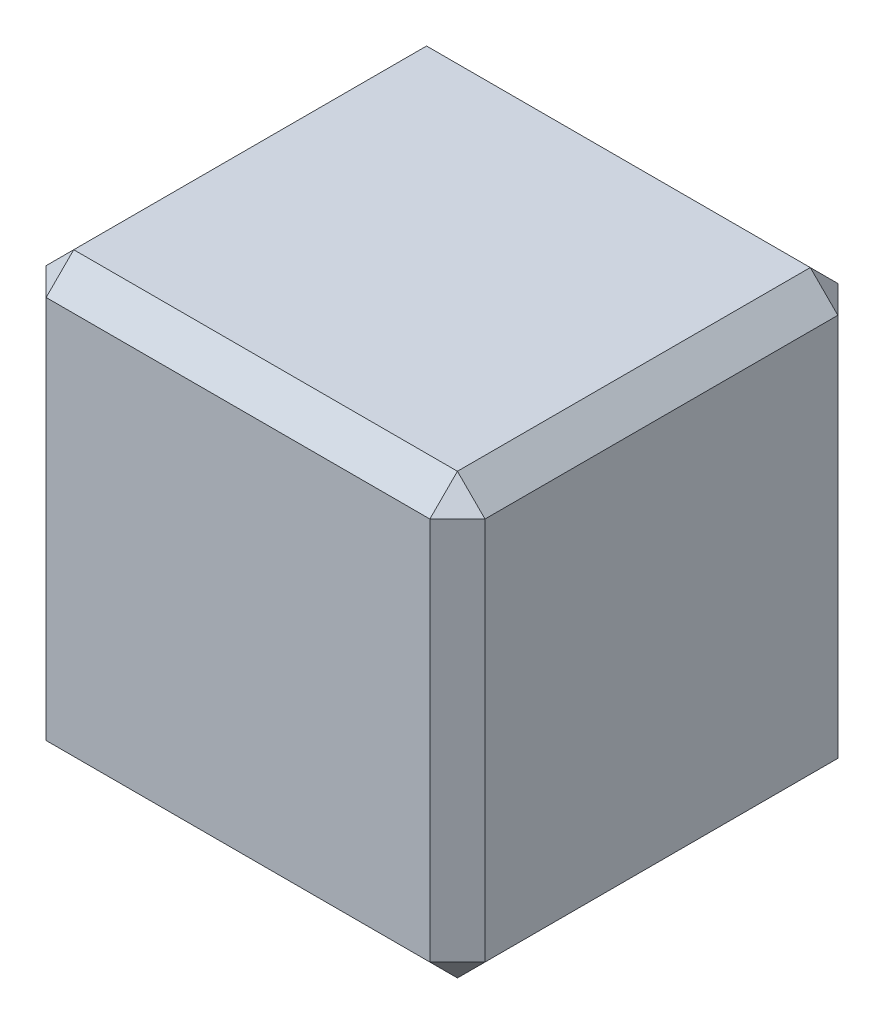
ISO-10303-21;
HEADER;
FILE_DESCRIPTION(('STEP AP214'),'2;1');
FILE_NAME('part.step','',(''),(''),'','','');
FILE_SCHEMA(('AUTOMOTIVE_DESIGN { 1 0 10303 214 1 1 1 1 }'));
ENDSEC;
DATA;
#1=APPLICATION_CONTEXT('core data for automotive mechanical design processes');
#2=APPLICATION_PROTOCOL_DEFINITION('international standard','automotive_design',2000,#1);
#3=PRODUCT_CONTEXT('',#1,'mechanical');
#4=PRODUCT('Part','Part','',(#3));
#5=PRODUCT_RELATED_PRODUCT_CATEGORY('part','',(#4));
#6=PRODUCT_DEFINITION_FORMATION('','',#4);
#7=PRODUCT_DEFINITION_CONTEXT('part definition',#1,'design');
#8=PRODUCT_DEFINITION('design','',#6,#7);
#9=PRODUCT_DEFINITION_SHAPE('','',#8);
#10=(LENGTH_UNIT() NAMED_UNIT(*) SI_UNIT(.MILLI.,.METRE.));
#11=(NAMED_UNIT(*) PLANE_ANGLE_UNIT() SI_UNIT($,.RADIAN.));
#12=(NAMED_UNIT(*) SI_UNIT($,.STERADIAN.) SOLID_ANGLE_UNIT());
#13=UNCERTAINTY_MEASURE_WITH_UNIT(LENGTH_MEASURE(1.E-05),#10,'distance_accuracy_value','');
#14=(GEOMETRIC_REPRESENTATION_CONTEXT(3) GLOBAL_UNCERTAINTY_ASSIGNED_CONTEXT((#13)) GLOBAL_UNIT_ASSIGNED_CONTEXT((#10,
#11,#12)) REPRESENTATION_CONTEXT('',''));
#15=CARTESIAN_POINT('',(0.,0.,0.));
#16=DIRECTION('',(0.,0.,1.));
#17=DIRECTION('',(1.,0.,0.));
#18=AXIS2_PLACEMENT_3D('',#15,#16,#17);
#19=CARTESIAN_POINT('',(12.6365,-12.6365,23.495));
#20=DIRECTION('',(-1.,0.,0.));
#21=DIRECTION('',(0.,0.,1.));
#22=AXIS2_PLACEMENT_3D('',#19,#20,#21);
#23=PLANE('',#22);
#24=DIRECTION('',(0.,-1.,0.));
#25=VECTOR('',#24,1.);
#26=CARTESIAN_POINT('',(12.6365,-12.6365,21.9075));
#27=LINE('',#26,#25);
#28=CARTESIAN_POINT('',(12.6365,11.049,21.9075));
#29=VERTEX_POINT('',#28);
#30=CARTESIAN_POINT('',(12.6365,-11.049,21.9075));
#31=VERTEX_POINT('',#30);
#32=EDGE_CURVE('E154',#29,#31,#27,.T.);
#33=ORIENTED_EDGE('',*,*,#32,.T.);
#34=DIRECTION('',(0.,0.,-1.));
#35=VECTOR('',#34,1.);
#36=CARTESIAN_POINT('',(12.6365,-11.049,23.495));
#37=LINE('',#36,#35);
#38=CARTESIAN_POINT('',(12.6365,-11.049,1.58750000000001));
#39=VERTEX_POINT('',#38);
#40=EDGE_CURVE('E222',#31,#39,#37,.T.);
#41=ORIENTED_EDGE('',*,*,#40,.T.);
#42=DIRECTION('',(0.,1.,0.));
#43=VECTOR('',#42,1.);
#44=CARTESIAN_POINT('',(12.6365,12.6365,1.58750000000001));
#45=LINE('',#44,#43);
#46=CARTESIAN_POINT('',(12.6365,11.049,1.58750000000001));
#47=VERTEX_POINT('',#46);
#48=EDGE_CURVE('E281',#39,#47,#45,.T.);
#49=ORIENTED_EDGE('',*,*,#48,.T.);
#50=DIRECTION('',(0.,0.,1.));
#51=VECTOR('',#50,1.);
#52=CARTESIAN_POINT('',(12.6365,11.049,23.495));
#53=LINE('',#52,#51);
#54=EDGE_CURVE('E279',#47,#29,#53,.T.);
#55=ORIENTED_EDGE('',*,*,#54,.T.);
#56=EDGE_LOOP('',(#33,#41,#49,#55));
#57=FACE_BOUND('',#56,.T.);
#58=ADVANCED_FACE('F35',(#57),#23,.F.);
#59=CARTESIAN_POINT('',(-12.6365,12.6365,23.495));
#60=DIRECTION('',(0.,-1.,0.));
#61=DIRECTION('',(0.,0.,-1.));
#62=AXIS2_PLACEMENT_3D('',#59,#60,#61);
#63=PLANE('',#62);
#64=DIRECTION('',(1.,0.,0.));
#65=VECTOR('',#64,1.);
#66=CARTESIAN_POINT('',(-12.6365,12.6365,21.9075));
#67=LINE('',#66,#65);
#68=CARTESIAN_POINT('',(-11.049,12.6365,21.9075));
#69=VERTEX_POINT('',#68);
#70=CARTESIAN_POINT('',(11.049,12.6365,21.9075));
#71=VERTEX_POINT('',#70);
#72=EDGE_CURVE('E44',#69,#71,#67,.T.);
#73=ORIENTED_EDGE('',*,*,#72,.T.);
#74=DIRECTION('',(0.,0.,-1.));
#75=VECTOR('',#74,1.);
#76=CARTESIAN_POINT('',(11.049,12.6365,23.495));
#77=LINE('',#76,#75);
#78=CARTESIAN_POINT('',(11.049,12.6365,1.58750000000001));
#79=VERTEX_POINT('',#78);
#80=EDGE_CURVE('E11',#71,#79,#77,.T.);
#81=ORIENTED_EDGE('',*,*,#80,.T.);
#82=DIRECTION('',(-1.,0.,0.));
#83=VECTOR('',#82,1.);
#84=CARTESIAN_POINT('',(-12.6365,12.6365,1.58750000000001));
#85=LINE('',#84,#83);
#86=CARTESIAN_POINT('',(-11.049,12.6365,1.58750000000001));
#87=VERTEX_POINT('',#86);
#88=EDGE_CURVE('E228',#79,#87,#85,.T.);
#89=ORIENTED_EDGE('',*,*,#88,.T.);
#90=DIRECTION('',(0.,0.,1.));
#91=VECTOR('',#90,1.);
#92=CARTESIAN_POINT('',(-11.049,12.6365,23.495));
#93=LINE('',#92,#91);
#94=EDGE_CURVE('E55',#87,#69,#93,.T.);
#95=ORIENTED_EDGE('',*,*,#94,.T.);
#96=EDGE_LOOP('',(#73,#81,#89,#95));
#97=FACE_BOUND('',#96,.T.);
#98=ADVANCED_FACE('F319',(#97),#63,.F.);
#99=CARTESIAN_POINT('',(-12.6365,-12.6365,23.495));
#100=DIRECTION('',(1.,0.,0.));
#101=DIRECTION('',(0.,0.,-1.));
#102=AXIS2_PLACEMENT_3D('',#99,#100,#101);
#103=PLANE('',#102);
#104=DIRECTION('',(0.,0.,1.));
#105=VECTOR('',#104,1.);
#106=CARTESIAN_POINT('',(-12.6365,-11.049,23.495));
#107=LINE('',#106,#105);
#108=CARTESIAN_POINT('',(-12.6365,-11.049,1.58750000000001));
#109=VERTEX_POINT('',#108);
#110=CARTESIAN_POINT('',(-12.6365,-11.049,21.9075));
#111=VERTEX_POINT('',#110);
#112=EDGE_CURVE('E217',#109,#111,#107,.T.);
#113=ORIENTED_EDGE('',*,*,#112,.T.);
#114=DIRECTION('',(0.,1.,0.));
#115=VECTOR('',#114,1.);
#116=CARTESIAN_POINT('',(-12.6365,-12.6365,21.9075));
#117=LINE('',#116,#115);
#118=CARTESIAN_POINT('',(-12.6365,11.049,21.9075));
#119=VERTEX_POINT('',#118);
#120=EDGE_CURVE('E220',#111,#119,#117,.T.);
#121=ORIENTED_EDGE('',*,*,#120,.T.);
#122=DIRECTION('',(0.,0.,-1.));
#123=VECTOR('',#122,1.);
#124=CARTESIAN_POINT('',(-12.6365,11.049,23.495));
#125=LINE('',#124,#123);
#126=CARTESIAN_POINT('',(-12.6365,11.049,1.58750000000001));
#127=VERTEX_POINT('',#126);
#128=EDGE_CURVE('E218',#119,#127,#125,.T.);
#129=ORIENTED_EDGE('',*,*,#128,.T.);
#130=DIRECTION('',(0.,-1.,0.));
#131=VECTOR('',#130,1.);
#132=CARTESIAN_POINT('',(-12.6365,-12.6365,1.58750000000001));
#133=LINE('',#132,#131);
#134=EDGE_CURVE('E214',#127,#109,#133,.T.);
#135=ORIENTED_EDGE('',*,*,#134,.T.);
#136=EDGE_LOOP('',(#113,#121,#129,#135));
#137=FACE_BOUND('',#136,.T.);
#138=ADVANCED_FACE('F299',(#137),#103,.F.);
#139=CARTESIAN_POINT('',(-12.6365,-12.6365,23.495));
#140=DIRECTION('',(0.,1.,0.));
#141=DIRECTION('',(0.,0.,1.));
#142=AXIS2_PLACEMENT_3D('',#139,#140,#141);
#143=PLANE('',#142);
#144=DIRECTION('',(1.,0.,0.));
#145=VECTOR('',#144,1.);
#146=CARTESIAN_POINT('',(12.6365,-12.6365,1.58750000000001));
#147=LINE('',#146,#145);
#148=CARTESIAN_POINT('',(-11.049,-12.6365,1.58750000000001));
#149=VERTEX_POINT('',#148);
#150=CARTESIAN_POINT('',(11.049,-12.6365,1.58750000000001));
#151=VERTEX_POINT('',#150);
#152=EDGE_CURVE('E258',#149,#151,#147,.T.);
#153=ORIENTED_EDGE('',*,*,#152,.T.);
#154=DIRECTION('',(0.,0.,1.));
#155=VECTOR('',#154,1.);
#156=CARTESIAN_POINT('',(11.049,-12.6365,23.495));
#157=LINE('',#156,#155);
#158=CARTESIAN_POINT('',(11.049,-12.6365,21.9075));
#159=VERTEX_POINT('',#158);
#160=EDGE_CURVE('E264',#151,#159,#157,.T.);
#161=ORIENTED_EDGE('',*,*,#160,.T.);
#162=DIRECTION('',(-1.,0.,0.));
#163=VECTOR('',#162,1.);
#164=CARTESIAN_POINT('',(-12.6365,-12.6365,21.9075));
#165=LINE('',#164,#163);
#166=CARTESIAN_POINT('',(-11.049,-12.6365,21.9075));
#167=VERTEX_POINT('',#166);
#168=EDGE_CURVE('E261',#159,#167,#165,.T.);
#169=ORIENTED_EDGE('',*,*,#168,.T.);
#170=DIRECTION('',(0.,0.,-1.));
#171=VECTOR('',#170,1.);
#172=CARTESIAN_POINT('',(-11.049,-12.6365,23.495));
#173=LINE('',#172,#171);
#174=EDGE_CURVE('E253',#167,#149,#173,.T.);
#175=ORIENTED_EDGE('',*,*,#174,.T.);
#176=EDGE_LOOP('',(#153,#161,#169,#175));
#177=FACE_BOUND('',#176,.T.);
#178=ADVANCED_FACE('F262',(#177),#143,.F.);
#179=CARTESIAN_POINT('',(0.,0.,23.495));
#180=DIRECTION('',(0.,0.,-1.));
#181=DIRECTION('',(-1.,0.,0.));
#182=AXIS2_PLACEMENT_3D('',#179,#180,#181);
#183=PLANE('',#182);
#184=DIRECTION('',(0.,-1.,0.));
#185=VECTOR('',#184,1.);
#186=CARTESIAN_POINT('',(-11.049,0.,23.495));
#187=LINE('',#186,#185);
#188=CARTESIAN_POINT('',(-11.049,11.049,23.495));
#189=VERTEX_POINT('',#188);
#190=CARTESIAN_POINT('',(-11.049,-11.049,23.495));
#191=VERTEX_POINT('',#190);
#192=EDGE_CURVE('E133',#189,#191,#187,.T.);
#193=ORIENTED_EDGE('',*,*,#192,.T.);
#194=DIRECTION('',(1.,0.,0.));
#195=VECTOR('',#194,1.);
#196=CARTESIAN_POINT('',(0.,-11.049,23.495));
#197=LINE('',#196,#195);
#198=CARTESIAN_POINT('',(11.049,-11.049,23.495));
#199=VERTEX_POINT('',#198);
#200=EDGE_CURVE('E129',#191,#199,#197,.T.);
#201=ORIENTED_EDGE('',*,*,#200,.T.);
#202=DIRECTION('',(0.,1.,0.));
#203=VECTOR('',#202,1.);
#204=CARTESIAN_POINT('',(11.049,0.,23.495));
#205=LINE('',#204,#203);
#206=CARTESIAN_POINT('',(11.049,11.049,23.495));
#207=VERTEX_POINT('',#206);
#208=EDGE_CURVE('E123',#199,#207,#205,.T.);
#209=ORIENTED_EDGE('',*,*,#208,.T.);
#210=DIRECTION('',(-1.,0.,0.));
#211=VECTOR('',#210,1.);
#212=CARTESIAN_POINT('',(0.,11.049,23.495));
#213=LINE('',#212,#211);
#214=EDGE_CURVE('E126',#207,#189,#213,.T.);
#215=ORIENTED_EDGE('',*,*,#214,.T.);
#216=EDGE_LOOP('',(#193,#201,#209,#215));
#217=FACE_BOUND('',#216,.T.);
#218=ADVANCED_FACE('F125',(#217),#183,.F.);
#219=CARTESIAN_POINT('',(0.,0.,0.));
#220=DIRECTION('',(0.,0.,-1.));
#221=DIRECTION('',(-1.,0.,0.));
#222=AXIS2_PLACEMENT_3D('',#219,#220,#221);
#223=PLANE('',#222);
#224=DIRECTION('',(0.,-1.,0.));
#225=VECTOR('',#224,1.);
#226=CARTESIAN_POINT('',(11.049,-12.6365,0.));
#227=LINE('',#226,#225);
#228=CARTESIAN_POINT('',(11.049,11.049,0.));
#229=VERTEX_POINT('',#228);
#230=CARTESIAN_POINT('',(11.049,-11.049,0.));
#231=VERTEX_POINT('',#230);
#232=EDGE_CURVE('E275',#229,#231,#227,.T.);
#233=ORIENTED_EDGE('',*,*,#232,.T.);
#234=DIRECTION('',(-1.,0.,0.));
#235=VECTOR('',#234,1.);
#236=CARTESIAN_POINT('',(-12.6365,-11.049,0.));
#237=LINE('',#236,#235);
#238=CARTESIAN_POINT('',(-11.049,-11.049,0.));
#239=VERTEX_POINT('',#238);
#240=EDGE_CURVE('E277',#231,#239,#237,.T.);
#241=ORIENTED_EDGE('',*,*,#240,.T.);
#242=DIRECTION('',(0.,1.,0.));
#243=VECTOR('',#242,1.);
#244=CARTESIAN_POINT('',(-11.049,12.6365,0.));
#245=LINE('',#244,#243);
#246=CARTESIAN_POINT('',(-11.049,11.049,0.));
#247=VERTEX_POINT('',#246);
#248=EDGE_CURVE('E212',#239,#247,#245,.T.);
#249=ORIENTED_EDGE('',*,*,#248,.T.);
#250=DIRECTION('',(1.,0.,0.));
#251=VECTOR('',#250,1.);
#252=CARTESIAN_POINT('',(12.6365,11.049,0.));
#253=LINE('',#252,#251);
#254=EDGE_CURVE('E269',#247,#229,#253,.T.);
#255=ORIENTED_EDGE('',*,*,#254,.T.);
#256=EDGE_LOOP('',(#233,#241,#249,#255));
#257=FACE_BOUND('',#256,.T.);
#258=ADVANCED_FACE('F358',(#257),#223,.T.);
#259=CARTESIAN_POINT('',(-12.6365,12.6365,1.58750000000001));
#260=DIRECTION('',(0.,0.707106781186546,-0.707106781186549));
#261=DIRECTION('',(1.,0.,0.));
#262=AXIS2_PLACEMENT_3D('',#259,#260,#261);
#263=PLANE('',#262);
#264=DIRECTION('',(0.,-0.707106781186549,-0.707106781186546));
#265=VECTOR('',#264,1.);
#266=CARTESIAN_POINT('',(-11.049,11.049,0.));
#267=LINE('',#266,#265);
#268=EDGE_CURVE('E39',#87,#247,#267,.T.);
#269=ORIENTED_EDGE('',*,*,#268,.F.);
#270=ORIENTED_EDGE('',*,*,#88,.F.);
#271=DIRECTION('',(0.,0.707106781186549,0.707106781186546));
#272=VECTOR('',#271,1.);
#273=CARTESIAN_POINT('',(11.049,11.84275,0.793750000000003));
#274=LINE('',#273,#272);
#275=EDGE_CURVE('E192',#229,#79,#274,.T.);
#276=ORIENTED_EDGE('',*,*,#275,.F.);
#277=ORIENTED_EDGE('',*,*,#254,.F.);
#278=EDGE_LOOP('',(#269,#270,#276,#277));
#279=FACE_BOUND('',#278,.T.);
#280=ADVANCED_FACE('F37',(#279),#263,.T.);
#281=CARTESIAN_POINT('',(-11.049,11.049,0.));
#282=DIRECTION('',(-0.577350269189626,0.577350269189623,-0.577350269189628));
#283=DIRECTION('',(-0.707106781186549,0.,0.707106781186546));
#284=AXIS2_PLACEMENT_3D('',#281,#282,#283);
#285=PLANE('',#284);
#286=DIRECTION('',(-0.707106781186546,-0.707106781186549,0.));
#287=VECTOR('',#286,1.);
#288=CARTESIAN_POINT('',(-11.84275,11.84275,1.58750000000001));
#289=LINE('',#288,#287);
#290=EDGE_CURVE('E187',#87,#127,#289,.T.);
#291=ORIENTED_EDGE('',*,*,#290,.F.);
#292=ORIENTED_EDGE('',*,*,#268,.T.);
#293=DIRECTION('',(-0.707106781186549,0.,0.707106781186546));
#294=VECTOR('',#293,1.);
#295=CARTESIAN_POINT('',(-11.049,11.049,0.));
#296=LINE('',#295,#294);
#297=EDGE_CURVE('E190',#127,#247,#296,.F.);
#298=ORIENTED_EDGE('',*,*,#297,.F.);
#299=EDGE_LOOP('',(#291,#292,#298));
#300=FACE_BOUND('',#299,.T.);
#301=ADVANCED_FACE('F204',(#300),#285,.T.);
#302=CARTESIAN_POINT('',(12.6365,11.049,1.58750000000001));
#303=DIRECTION('',(0.577350269189626,0.577350269189623,-0.577350269189628));
#304=DIRECTION('',(-0.707106781186549,0.,-0.707106781186546));
#305=AXIS2_PLACEMENT_3D('',#302,#303,#304);
#306=PLANE('',#305);
#307=DIRECTION('',(-0.707106781186549,0.,-0.707106781186546));
#308=VECTOR('',#307,1.);
#309=CARTESIAN_POINT('',(12.6365,11.049,1.58750000000001));
#310=LINE('',#309,#308);
#311=EDGE_CURVE('E182',#229,#47,#310,.F.);
#312=ORIENTED_EDGE('',*,*,#311,.F.);
#313=ORIENTED_EDGE('',*,*,#275,.T.);
#314=DIRECTION('',(-0.707106781186546,0.707106781186549,0.));
#315=VECTOR('',#314,1.);
#316=CARTESIAN_POINT('',(12.6365,11.049,1.58750000000001));
#317=LINE('',#316,#315);
#318=EDGE_CURVE('E185',#47,#79,#317,.T.);
#319=ORIENTED_EDGE('',*,*,#318,.F.);
#320=EDGE_LOOP('',(#312,#313,#319));
#321=FACE_BOUND('',#320,.T.);
#322=ADVANCED_FACE('F355',(#321),#306,.T.);
#323=CARTESIAN_POINT('',(-12.6365,-12.6365,1.58750000000001));
#324=DIRECTION('',(-0.707106781186546,0.,-0.707106781186549));
#325=DIRECTION('',(0.,1.,0.));
#326=AXIS2_PLACEMENT_3D('',#323,#324,#325);
#327=PLANE('',#326);
#328=ORIENTED_EDGE('',*,*,#297,.T.);
#329=ORIENTED_EDGE('',*,*,#248,.F.);
#330=DIRECTION('',(0.707106781186549,0.,-0.707106781186546));
#331=VECTOR('',#330,1.);
#332=CARTESIAN_POINT('',(-11.049,-11.049,0.));
#333=LINE('',#332,#331);
#334=EDGE_CURVE('E177',#109,#239,#333,.T.);
#335=ORIENTED_EDGE('',*,*,#334,.F.);
#336=ORIENTED_EDGE('',*,*,#134,.F.);
#337=EDGE_LOOP('',(#328,#329,#335,#336));
#338=FACE_BOUND('',#337,.T.);
#339=ADVANCED_FACE('F210',(#338),#327,.T.);
#340=CARTESIAN_POINT('',(-12.6365,11.049,23.495));
#341=DIRECTION('',(0.707106781186549,-0.707106781186546,0.));
#342=DIRECTION('',(0.,0.,-1.));
#343=AXIS2_PLACEMENT_3D('',#340,#341,#342);
#344=PLANE('',#343);
#345=ORIENTED_EDGE('',*,*,#290,.T.);
#346=ORIENTED_EDGE('',*,*,#128,.F.);
#347=DIRECTION('',(0.707106781186546,0.707106781186549,0.));
#348=VECTOR('',#347,1.);
#349=CARTESIAN_POINT('',(-12.6365,11.049,21.9075));
#350=LINE('',#349,#348);
#351=EDGE_CURVE('E174',#69,#119,#350,.F.);
#352=ORIENTED_EDGE('',*,*,#351,.F.);
#353=ORIENTED_EDGE('',*,*,#94,.F.);
#354=EDGE_LOOP('',(#345,#346,#352,#353));
#355=FACE_BOUND('',#354,.T.);
#356=ADVANCED_FACE('F303',(#355),#344,.F.);
#357=CARTESIAN_POINT('',(0.,11.049,23.495));
#358=DIRECTION('',(0.,-0.707106781186546,-0.707106781186549));
#359=DIRECTION('',(-1.,0.,0.));
#360=AXIS2_PLACEMENT_3D('',#357,#358,#359);
#361=PLANE('',#360);
#362=DIRECTION('',(0.,0.707106781186549,-0.707106781186546));
#363=VECTOR('',#362,1.);
#364=CARTESIAN_POINT('',(11.049,11.049,23.495));
#365=LINE('',#364,#363);
#366=EDGE_CURVE('E139',#71,#207,#365,.F.);
#367=ORIENTED_EDGE('',*,*,#366,.F.);
#368=ORIENTED_EDGE('',*,*,#72,.F.);
#369=DIRECTION('',(0.,-0.707106781186549,0.707106781186546));
#370=VECTOR('',#369,1.);
#371=CARTESIAN_POINT('',(-11.049,11.84275,22.70125));
#372=LINE('',#371,#370);
#373=EDGE_CURVE('E142',#189,#69,#372,.F.);
#374=ORIENTED_EDGE('',*,*,#373,.F.);
#375=ORIENTED_EDGE('',*,*,#214,.F.);
#376=EDGE_LOOP('',(#367,#368,#374,#375));
#377=FACE_BOUND('',#376,.T.);
#378=ADVANCED_FACE('F138',(#377),#361,.F.);
#379=CARTESIAN_POINT('',(11.049,12.6365,23.495));
#380=DIRECTION('',(-0.707106781186549,-0.707106781186546,0.));
#381=DIRECTION('',(0.,0.,-1.));
#382=AXIS2_PLACEMENT_3D('',#379,#380,#381);
#383=PLANE('',#382);
#384=ORIENTED_EDGE('',*,*,#318,.T.);
#385=ORIENTED_EDGE('',*,*,#80,.F.);
#386=DIRECTION('',(0.707106781186546,-0.707106781186549,0.));
#387=VECTOR('',#386,1.);
#388=CARTESIAN_POINT('',(11.84275,11.84275,21.9075));
#389=LINE('',#388,#387);
#390=EDGE_CURVE('E151',#29,#71,#389,.F.);
#391=ORIENTED_EDGE('',*,*,#390,.F.);
#392=ORIENTED_EDGE('',*,*,#54,.F.);
#393=EDGE_LOOP('',(#384,#385,#391,#392));
#394=FACE_BOUND('',#393,.T.);
#395=ADVANCED_FACE('F357',(#394),#383,.F.);
#396=CARTESIAN_POINT('',(12.6365,-12.6365,1.58750000000001));
#397=DIRECTION('',(0.707106781186546,0.,-0.707106781186549));
#398=DIRECTION('',(0.,-1.,0.));
#399=AXIS2_PLACEMENT_3D('',#396,#397,#398);
#400=PLANE('',#399);
#401=ORIENTED_EDGE('',*,*,#311,.T.);
#402=ORIENTED_EDGE('',*,*,#48,.F.);
#403=DIRECTION('',(0.707106781186549,0.,0.707106781186546));
#404=VECTOR('',#403,1.);
#405=CARTESIAN_POINT('',(11.84275,-11.049,0.793750000000003));
#406=LINE('',#405,#404);
#407=EDGE_CURVE('E169',#231,#39,#406,.T.);
#408=ORIENTED_EDGE('',*,*,#407,.F.);
#409=ORIENTED_EDGE('',*,*,#232,.F.);
#410=EDGE_LOOP('',(#401,#402,#408,#409));
#411=FACE_BOUND('',#410,.T.);
#412=ADVANCED_FACE('F353',(#411),#400,.T.);
#413=CARTESIAN_POINT('',(-12.6365,-12.6365,1.58750000000001));
#414=DIRECTION('',(0.,-0.707106781186546,-0.707106781186549));
#415=DIRECTION('',(-1.,0.,0.));
#416=AXIS2_PLACEMENT_3D('',#413,#414,#415);
#417=PLANE('',#416);
#418=DIRECTION('',(0.,-0.707106781186549,0.707106781186546));
#419=VECTOR('',#418,1.);
#420=CARTESIAN_POINT('',(-11.049,-11.049,0.));
#421=LINE('',#420,#419);
#422=EDGE_CURVE('E179',#239,#149,#421,.T.);
#423=ORIENTED_EDGE('',*,*,#422,.F.);
#424=ORIENTED_EDGE('',*,*,#240,.F.);
#425=DIRECTION('',(0.,0.707106781186549,-0.707106781186546));
#426=VECTOR('',#425,1.);
#427=CARTESIAN_POINT('',(11.049,-12.6365,1.58750000000001));
#428=LINE('',#427,#426);
#429=EDGE_CURVE('E166',#151,#231,#428,.T.);
#430=ORIENTED_EDGE('',*,*,#429,.F.);
#431=ORIENTED_EDGE('',*,*,#152,.F.);
#432=EDGE_LOOP('',(#423,#424,#430,#431));
#433=FACE_BOUND('',#432,.T.);
#434=ADVANCED_FACE('F315',(#433),#417,.T.);
#435=CARTESIAN_POINT('',(-11.049,-11.049,0.));
#436=DIRECTION('',(-0.577350269189626,-0.577350269189623,-0.577350269189628));
#437=DIRECTION('',(-0.707106781186549,0.,0.707106781186546));
#438=AXIS2_PLACEMENT_3D('',#435,#436,#437);
#439=PLANE('',#438);
#440=ORIENTED_EDGE('',*,*,#334,.T.);
#441=ORIENTED_EDGE('',*,*,#422,.T.);
#442=DIRECTION('',(0.707106781186546,-0.707106781186549,0.));
#443=VECTOR('',#442,1.);
#444=CARTESIAN_POINT('',(-11.84275,-11.84275,1.58750000000001));
#445=LINE('',#444,#443);
#446=EDGE_CURVE('E158',#109,#149,#445,.T.);
#447=ORIENTED_EDGE('',*,*,#446,.F.);
#448=EDGE_LOOP('',(#440,#441,#447));
#449=FACE_BOUND('',#448,.T.);
#450=ADVANCED_FACE('F307',(#449),#439,.T.);
#451=CARTESIAN_POINT('',(-12.6365,11.049,21.9075));
#452=DIRECTION('',(-0.577350269189628,0.577350269189623,0.577350269189626));
#453=DIRECTION('',(0.707106781186546,0.,0.707106781186549));
#454=AXIS2_PLACEMENT_3D('',#451,#452,#453);
#455=PLANE('',#454);
#456=ORIENTED_EDGE('',*,*,#373,.T.);
#457=ORIENTED_EDGE('',*,*,#351,.T.);
#458=DIRECTION('',(-0.707106781186546,0.,-0.707106781186549));
#459=VECTOR('',#458,1.);
#460=CARTESIAN_POINT('',(-12.6365,11.049,21.9075));
#461=LINE('',#460,#459);
#462=EDGE_CURVE('E155',#189,#119,#461,.T.);
#463=ORIENTED_EDGE('',*,*,#462,.F.);
#464=EDGE_LOOP('',(#456,#457,#463));
#465=FACE_BOUND('',#464,.T.);
#466=ADVANCED_FACE('F305',(#465),#455,.T.);
#467=CARTESIAN_POINT('',(11.049,11.049,23.495));
#468=DIRECTION('',(0.577350269189628,0.577350269189623,0.577350269189626));
#469=DIRECTION('',(0.707106781186546,0.,-0.707106781186549));
#470=AXIS2_PLACEMENT_3D('',#467,#468,#469);
#471=PLANE('',#470);
#472=ORIENTED_EDGE('',*,*,#390,.T.);
#473=ORIENTED_EDGE('',*,*,#366,.T.);
#474=DIRECTION('',(-0.707106781186546,0.,0.707106781186549));
#475=VECTOR('',#474,1.);
#476=CARTESIAN_POINT('',(11.049,11.049,23.495));
#477=LINE('',#476,#475);
#478=EDGE_CURVE('E148',#29,#207,#477,.T.);
#479=ORIENTED_EDGE('',*,*,#478,.F.);
#480=EDGE_LOOP('',(#472,#473,#479));
#481=FACE_BOUND('',#480,.T.);
#482=ADVANCED_FACE('F147',(#481),#471,.T.);
#483=CARTESIAN_POINT('',(11.049,-12.6365,1.58750000000001));
#484=DIRECTION('',(0.577350269189623,-0.577350269189626,-0.577350269189628));
#485=DIRECTION('',(0.,0.707106781186549,-0.707106781186546));
#486=AXIS2_PLACEMENT_3D('',#483,#484,#485);
#487=PLANE('',#486);
#488=ORIENTED_EDGE('',*,*,#429,.T.);
#489=ORIENTED_EDGE('',*,*,#407,.T.);
#490=DIRECTION('',(0.707106781186549,0.707106781186546,0.));
#491=VECTOR('',#490,1.);
#492=CARTESIAN_POINT('',(11.049,-12.6365,1.58750000000001));
#493=LINE('',#492,#491);
#494=EDGE_CURVE('E156',#151,#39,#493,.T.);
#495=ORIENTED_EDGE('',*,*,#494,.F.);
#496=EDGE_LOOP('',(#488,#489,#495));
#497=FACE_BOUND('',#496,.T.);
#498=ADVANCED_FACE('F313',(#497),#487,.T.);
#499=CARTESIAN_POINT('',(-11.049,-12.6365,23.495));
#500=DIRECTION('',(0.707106781186549,0.707106781186546,0.));
#501=DIRECTION('',(0.,0.,-1.));
#502=AXIS2_PLACEMENT_3D('',#499,#500,#501);
#503=PLANE('',#502);
#504=ORIENTED_EDGE('',*,*,#446,.T.);
#505=ORIENTED_EDGE('',*,*,#174,.F.);
#506=DIRECTION('',(-0.707106781186546,0.707106781186549,0.));
#507=VECTOR('',#506,1.);
#508=CARTESIAN_POINT('',(-11.049,-12.6365,21.9075));
#509=LINE('',#508,#507);
#510=EDGE_CURVE('E160',#111,#167,#509,.F.);
#511=ORIENTED_EDGE('',*,*,#510,.F.);
#512=ORIENTED_EDGE('',*,*,#112,.F.);
#513=EDGE_LOOP('',(#504,#505,#511,#512));
#514=FACE_BOUND('',#513,.T.);
#515=ADVANCED_FACE('F255',(#514),#503,.F.);
#516=CARTESIAN_POINT('',(-11.049,0.,23.495));
#517=DIRECTION('',(0.707106781186549,0.,-0.707106781186546));
#518=DIRECTION('',(0.,-1.,0.));
#519=AXIS2_PLACEMENT_3D('',#516,#517,#518);
#520=PLANE('',#519);
#521=ORIENTED_EDGE('',*,*,#462,.T.);
#522=ORIENTED_EDGE('',*,*,#120,.F.);
#523=DIRECTION('',(0.707106781186546,0.,0.707106781186549));
#524=VECTOR('',#523,1.);
#525=CARTESIAN_POINT('',(-11.84275,-11.049,22.70125));
#526=LINE('',#525,#524);
#527=EDGE_CURVE('E242',#191,#111,#526,.F.);
#528=ORIENTED_EDGE('',*,*,#527,.F.);
#529=ORIENTED_EDGE('',*,*,#192,.F.);
#530=EDGE_LOOP('',(#521,#522,#528,#529));
#531=FACE_BOUND('',#530,.T.);
#532=ADVANCED_FACE('F298',(#531),#520,.F.);
#533=CARTESIAN_POINT('',(11.049,0.,23.495));
#534=DIRECTION('',(-0.707106781186549,0.,-0.707106781186546));
#535=DIRECTION('',(0.,1.,0.));
#536=AXIS2_PLACEMENT_3D('',#533,#534,#535);
#537=PLANE('',#536);
#538=ORIENTED_EDGE('',*,*,#478,.T.);
#539=ORIENTED_EDGE('',*,*,#208,.F.);
#540=DIRECTION('',(0.707106781186546,0.,-0.707106781186549));
#541=VECTOR('',#540,1.);
#542=CARTESIAN_POINT('',(11.049,-11.049,23.495));
#543=LINE('',#542,#541);
#544=EDGE_CURVE('E239',#31,#199,#543,.F.);
#545=ORIENTED_EDGE('',*,*,#544,.F.);
#546=ORIENTED_EDGE('',*,*,#32,.F.);
#547=EDGE_LOOP('',(#538,#539,#545,#546));
#548=FACE_BOUND('',#547,.T.);
#549=ADVANCED_FACE('F153',(#548),#537,.F.);
#550=CARTESIAN_POINT('',(12.6365,-11.049,23.495));
#551=DIRECTION('',(-0.707106781186546,0.707106781186549,0.));
#552=DIRECTION('',(0.,0.,-1.));
#553=AXIS2_PLACEMENT_3D('',#550,#551,#552);
#554=PLANE('',#553);
#555=ORIENTED_EDGE('',*,*,#494,.T.);
#556=ORIENTED_EDGE('',*,*,#40,.F.);
#557=DIRECTION('',(-0.707106781186549,-0.707106781186546,0.));
#558=VECTOR('',#557,1.);
#559=CARTESIAN_POINT('',(11.84275,-11.84275,21.9075));
#560=LINE('',#559,#558);
#561=EDGE_CURVE('E236',#159,#31,#560,.F.);
#562=ORIENTED_EDGE('',*,*,#561,.F.);
#563=ORIENTED_EDGE('',*,*,#160,.F.);
#564=EDGE_LOOP('',(#555,#556,#562,#563));
#565=FACE_BOUND('',#564,.T.);
#566=ADVANCED_FACE('F288',(#565),#554,.F.);
#567=CARTESIAN_POINT('',(-11.049,-12.6365,21.9075));
#568=DIRECTION('',(-0.577350269189628,-0.577350269189626,0.577350269189623));
#569=DIRECTION('',(0.707106781186546,-0.707106781186549,0.));
#570=AXIS2_PLACEMENT_3D('',#567,#568,#569);
#571=PLANE('',#570);
#572=ORIENTED_EDGE('',*,*,#527,.T.);
#573=ORIENTED_EDGE('',*,*,#510,.T.);
#574=DIRECTION('',(0.,-0.707106781186546,-0.707106781186549));
#575=VECTOR('',#574,1.);
#576=CARTESIAN_POINT('',(-11.049,-12.6365,21.9075));
#577=LINE('',#576,#575);
#578=EDGE_CURVE('E234',#191,#167,#577,.T.);
#579=ORIENTED_EDGE('',*,*,#578,.F.);
#580=EDGE_LOOP('',(#572,#573,#579));
#581=FACE_BOUND('',#580,.T.);
#582=ADVANCED_FACE('F249',(#581),#571,.T.);
#583=CARTESIAN_POINT('',(11.049,-11.049,23.495));
#584=DIRECTION('',(0.577350269189626,-0.577350269189628,0.577350269189623));
#585=DIRECTION('',(0.707106781186549,0.707106781186546,0.));
#586=AXIS2_PLACEMENT_3D('',#583,#584,#585);
#587=PLANE('',#586);
#588=ORIENTED_EDGE('',*,*,#561,.T.);
#589=ORIENTED_EDGE('',*,*,#544,.T.);
#590=DIRECTION('',(0.,0.707106781186546,0.707106781186549));
#591=VECTOR('',#590,1.);
#592=CARTESIAN_POINT('',(11.049,-11.049,23.495));
#593=LINE('',#592,#591);
#594=EDGE_CURVE('E232',#159,#199,#593,.T.);
#595=ORIENTED_EDGE('',*,*,#594,.F.);
#596=EDGE_LOOP('',(#588,#589,#595));
#597=FACE_BOUND('',#596,.T.);
#598=ADVANCED_FACE('F291',(#597),#587,.T.);
#599=CARTESIAN_POINT('',(0.,-11.049,23.495));
#600=DIRECTION('',(0.,0.707106781186549,-0.707106781186546));
#601=DIRECTION('',(1.,0.,0.));
#602=AXIS2_PLACEMENT_3D('',#599,#600,#601);
#603=PLANE('',#602);
#604=ORIENTED_EDGE('',*,*,#578,.T.);
#605=ORIENTED_EDGE('',*,*,#168,.F.);
#606=ORIENTED_EDGE('',*,*,#594,.T.);
#607=ORIENTED_EDGE('',*,*,#200,.F.);
#608=EDGE_LOOP('',(#604,#605,#606,#607));
#609=FACE_BOUND('',#608,.T.);
#610=ADVANCED_FACE('F292',(#609),#603,.F.);
#611=CLOSED_SHELL('',(#58,#98,#138,#178,#218,#258,#280,#301,#322,#339,#356,#378,#395,#412,#434,
#450,#466,#482,#498,#515,#532,#549,#566,#582,#598,#610));
#612=MANIFOLD_SOLID_BREP('B2',#611);
#613=ADVANCED_BREP_SHAPE_REPRESENTATION('',(#18,#612),#14);
#614=SHAPE_DEFINITION_REPRESENTATION(#9,#613);
ENDSEC;
END-ISO-10303-21;
